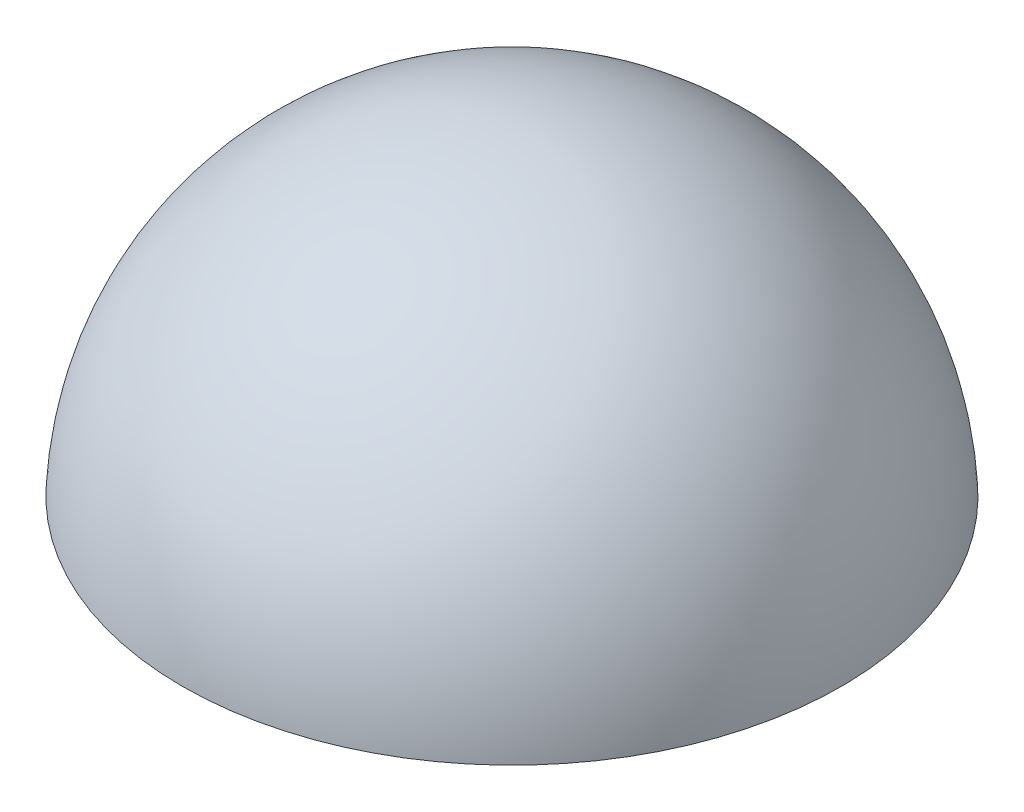
ISO-10303-21;
HEADER;
FILE_DESCRIPTION(('STEP AP214'),'2;1');
FILE_NAME('part.step','',(''),(''),'','','');
FILE_SCHEMA(('AUTOMOTIVE_DESIGN { 1 0 10303 214 1 1 1 1 }'));
ENDSEC;
DATA;
#1=APPLICATION_CONTEXT('core data for automotive mechanical design processes');
#2=APPLICATION_PROTOCOL_DEFINITION('international standard','automotive_design',2000,#1);
#3=PRODUCT_CONTEXT('',#1,'mechanical');
#4=PRODUCT('Part','Part','',(#3));
#5=PRODUCT_RELATED_PRODUCT_CATEGORY('part','',(#4));
#6=PRODUCT_DEFINITION_FORMATION('','',#4);
#7=PRODUCT_DEFINITION_CONTEXT('part definition',#1,'design');
#8=PRODUCT_DEFINITION('design','',#6,#7);
#9=PRODUCT_DEFINITION_SHAPE('','',#8);
#10=(LENGTH_UNIT() NAMED_UNIT(*) SI_UNIT(.MILLI.,.METRE.));
#11=(NAMED_UNIT(*) PLANE_ANGLE_UNIT() SI_UNIT($,.RADIAN.));
#12=(NAMED_UNIT(*) SI_UNIT($,.STERADIAN.) SOLID_ANGLE_UNIT());
#13=UNCERTAINTY_MEASURE_WITH_UNIT(LENGTH_MEASURE(1.E-05),#10,'distance_accuracy_value','');
#14=(GEOMETRIC_REPRESENTATION_CONTEXT(3) GLOBAL_UNCERTAINTY_ASSIGNED_CONTEXT((#13)) GLOBAL_UNIT_ASSIGNED_CONTEXT((#10,
#11,#12)) REPRESENTATION_CONTEXT('',''));
#15=CARTESIAN_POINT('',(0.,0.,0.));
#16=DIRECTION('',(0.,0.,1.));
#17=DIRECTION('',(1.,0.,0.));
#18=AXIS2_PLACEMENT_3D('',#15,#16,#17);
#19=CARTESIAN_POINT('',(0.,0.,0.));
#20=DIRECTION('',(0.,0.,1.));
#21=DIRECTION('',(-1.,0.,0.));
#22=AXIS2_PLACEMENT_3D('',#19,#20,#21);
#23=SPHERICAL_SURFACE('',#22,44.45);
#24=CARTESIAN_POINT('',(0.,0.,0.));
#25=DIRECTION('',(0.,1.,0.));
#26=DIRECTION('',(0.,0.,1.));
#27=AXIS2_PLACEMENT_3D('',#24,#25,#26);
#28=SPHERICAL_SURFACE('',#27,44.45);
#29=CARTESIAN_POINT('',(0.,2.,0.));
#30=DIRECTION('',(0.,1.,0.));
#31=DIRECTION('',(0.,0.,1.));
#32=AXIS2_PLACEMENT_3D('',#29,#30,#31);
#33=CIRCLE('',#32,44.404982828507);
#34=CARTESIAN_POINT('',(0.,2.,44.404982828507));
#35=VERTEX_POINT('',#34);
#36=EDGE_CURVE('E39',#35,#35,#33,.T.);
#37=ORIENTED_EDGE('',*,*,#36,.T.);
#38=EDGE_LOOP('',(#37));
#39=FACE_BOUND('',#38,.T.);
#40=ADVANCED_FACE('F36',(#39),#28,.T.);
#41=CARTESIAN_POINT('',(0.,2.,0.));
#42=DIRECTION('',(0.,1.,0.));
#43=DIRECTION('',(0.,0.,1.));
#44=AXIS2_PLACEMENT_3D('',#41,#42,#43);
#45=PLANE('',#44);
#46=CARTESIAN_POINT('',(0.,2.,0.));
#47=DIRECTION('',(0.,1.,0.));
#48=DIRECTION('',(0.,0.,1.));
#49=AXIS2_PLACEMENT_3D('',#46,#47,#48);
#50=CIRCLE('',#49,42.4028595733825);
#51=CARTESIAN_POINT('',(0.,2.,42.4028595733825));
#52=VERTEX_POINT('',#51);
#53=EDGE_CURVE('E10',#52,#52,#50,.T.);
#54=ORIENTED_EDGE('',*,*,#53,.T.);
#55=EDGE_LOOP('',(#54));
#56=FACE_BOUND('',#55,.T.);
#57=ORIENTED_EDGE('',*,*,#36,.F.);
#58=EDGE_LOOP('',(#57));
#59=FACE_BOUND('',#58,.T.);
#60=ADVANCED_FACE('F49',(#56,#59),#45,.F.);
#61=CARTESIAN_POINT('',(0.,0.,0.));
#62=DIRECTION('',(0.,0.,1.));
#63=DIRECTION('',(-1.,0.,0.));
#64=AXIS2_PLACEMENT_3D('',#61,#62,#63);
#65=SPHERICAL_SURFACE('',#64,42.45);
#66=CARTESIAN_POINT('',(0.,0.,0.));
#67=DIRECTION('',(0.,1.,0.));
#68=DIRECTION('',(0.,0.,1.));
#69=AXIS2_PLACEMENT_3D('',#66,#67,#68);
#70=SPHERICAL_SURFACE('',#69,42.45);
#71=ORIENTED_EDGE('',*,*,#53,.F.);
#72=EDGE_LOOP('',(#71));
#73=FACE_BOUND('',#72,.T.);
#74=ADVANCED_FACE('F51',(#73),#70,.F.);
#75=CLOSED_SHELL('',(#40,#60,#74));
#76=MANIFOLD_SOLID_BREP('B2',#75);
#77=ADVANCED_BREP_SHAPE_REPRESENTATION('',(#18,#76),#14);
#78=SHAPE_DEFINITION_REPRESENTATION(#9,#77);
ENDSEC;
END-ISO-10303-21;
